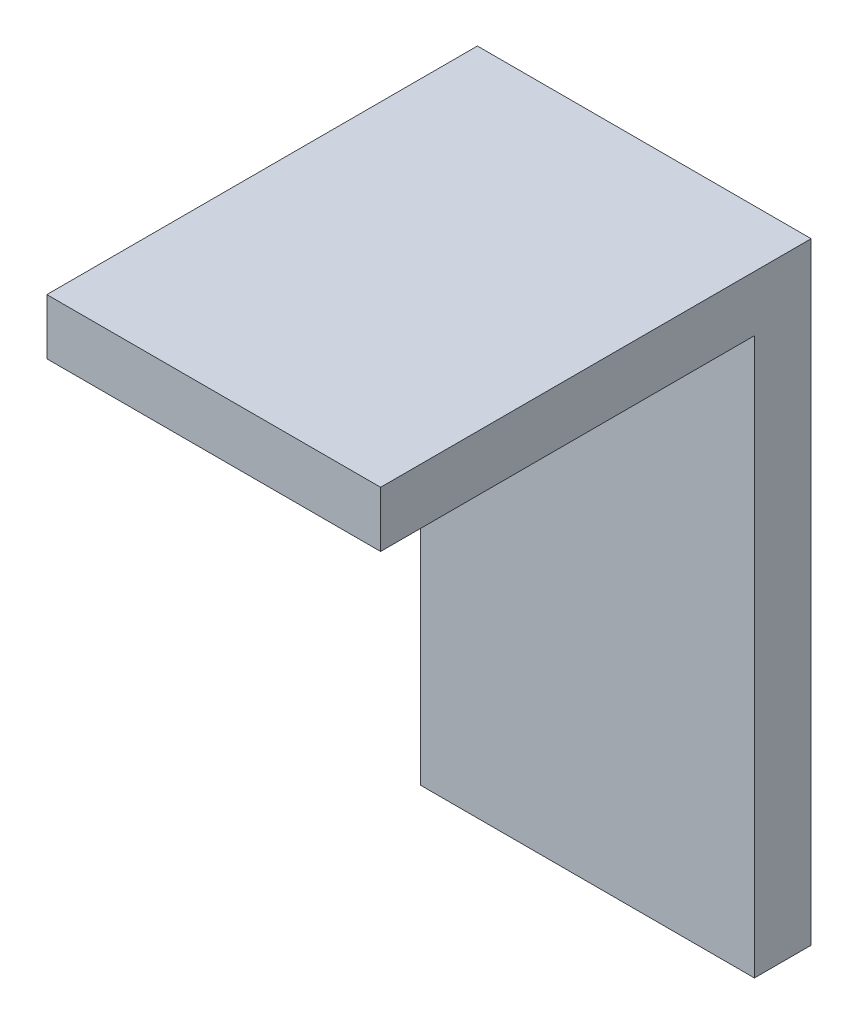
ISO-10303-21;
HEADER;
FILE_DESCRIPTION(('STEP AP214'),'2;1');
FILE_NAME('part.step','',(''),(''),'','','');
FILE_SCHEMA(('AUTOMOTIVE_DESIGN { 1 0 10303 214 1 1 1 1 }'));
ENDSEC;
DATA;
#1=APPLICATION_CONTEXT('core data for automotive mechanical design processes');
#2=APPLICATION_PROTOCOL_DEFINITION('international standard','automotive_design',2000,#1);
#3=PRODUCT_CONTEXT('',#1,'mechanical');
#4=PRODUCT('Part','Part','',(#3));
#5=PRODUCT_RELATED_PRODUCT_CATEGORY('part','',(#4));
#6=PRODUCT_DEFINITION_FORMATION('','',#4);
#7=PRODUCT_DEFINITION_CONTEXT('part definition',#1,'design');
#8=PRODUCT_DEFINITION('design','',#6,#7);
#9=PRODUCT_DEFINITION_SHAPE('','',#8);
#10=(LENGTH_UNIT() NAMED_UNIT(*) SI_UNIT(.MILLI.,.METRE.));
#11=(NAMED_UNIT(*) PLANE_ANGLE_UNIT() SI_UNIT($,.RADIAN.));
#12=(NAMED_UNIT(*) SI_UNIT($,.STERADIAN.) SOLID_ANGLE_UNIT());
#13=UNCERTAINTY_MEASURE_WITH_UNIT(LENGTH_MEASURE(1.E-05),#10,'distance_accuracy_value','');
#14=(GEOMETRIC_REPRESENTATION_CONTEXT(3) GLOBAL_UNCERTAINTY_ASSIGNED_CONTEXT((#13)) GLOBAL_UNIT_ASSIGNED_CONTEXT((#10,
#11,#12)) REPRESENTATION_CONTEXT('',''));
#15=CARTESIAN_POINT('',(0.,0.,0.));
#16=DIRECTION('',(0.,0.,1.));
#17=DIRECTION('',(1.,0.,0.));
#18=AXIS2_PLACEMENT_3D('',#15,#16,#17);
#19=CARTESIAN_POINT('',(3.1,4.55,0.));
#20=DIRECTION('',(-1.,0.,0.));
#21=DIRECTION('',(0.,0.,1.));
#22=AXIS2_PLACEMENT_3D('',#19,#20,#21);
#23=PLANE('',#22);
#24=DIRECTION('',(0.,1.,0.));
#25=VECTOR('',#24,1.);
#26=CARTESIAN_POINT('',(3.1,4.,0.));
#27=LINE('',#26,#25);
#28=CARTESIAN_POINT('',(3.1,4.,0.));
#29=VERTEX_POINT('',#28);
#30=CARTESIAN_POINT('',(3.1,4.55,0.));
#31=VERTEX_POINT('',#30);
#32=EDGE_CURVE('E11',#29,#31,#27,.T.);
#33=ORIENTED_EDGE('',*,*,#32,.F.);
#34=DIRECTION('',(0.,0.,-1.));
#35=VECTOR('',#34,1.);
#36=CARTESIAN_POINT('',(3.1,4.,0.051));
#37=LINE('',#36,#35);
#38=CARTESIAN_POINT('',(3.1,4.,0.051));
#39=VERTEX_POINT('',#38);
#40=EDGE_CURVE('E24',#39,#29,#37,.T.);
#41=ORIENTED_EDGE('',*,*,#40,.F.);
#42=DIRECTION('',(0.,-1.,0.));
#43=VECTOR('',#42,1.);
#44=CARTESIAN_POINT('',(3.1,4.5,0.051));
#45=LINE('',#44,#43);
#46=CARTESIAN_POINT('',(3.1,4.5,0.051));
#47=VERTEX_POINT('',#46);
#48=EDGE_CURVE('E87',#47,#39,#45,.T.);
#49=ORIENTED_EDGE('',*,*,#48,.F.);
#50=DIRECTION('',(0.,0.,-1.));
#51=VECTOR('',#50,1.);
#52=CARTESIAN_POINT('',(3.1,4.5,0.387));
#53=LINE('',#52,#51);
#54=CARTESIAN_POINT('',(3.1,4.5,0.387));
#55=VERTEX_POINT('',#54);
#56=EDGE_CURVE('E114',#55,#47,#53,.T.);
#57=ORIENTED_EDGE('',*,*,#56,.F.);
#58=DIRECTION('',(0.,-1.,0.));
#59=VECTOR('',#58,1.);
#60=CARTESIAN_POINT('',(3.1,4.55,0.387));
#61=LINE('',#60,#59);
#62=CARTESIAN_POINT('',(3.1,4.55,0.387));
#63=VERTEX_POINT('',#62);
#64=EDGE_CURVE('E111',#63,#55,#61,.T.);
#65=ORIENTED_EDGE('',*,*,#64,.F.);
#66=DIRECTION('',(0.,0.,1.));
#67=VECTOR('',#66,1.);
#68=CARTESIAN_POINT('',(3.1,4.55,0.));
#69=LINE('',#68,#67);
#70=EDGE_CURVE('E108',#31,#63,#69,.T.);
#71=ORIENTED_EDGE('',*,*,#70,.F.);
#72=EDGE_LOOP('',(#33,#41,#49,#57,#65,#71));
#73=FACE_BOUND('',#72,.T.);
#74=ADVANCED_FACE('F17',(#73),#23,.T.);
#75=CARTESIAN_POINT('',(3.4,4.,0.));
#76=DIRECTION('',(1.,0.,0.));
#77=DIRECTION('',(0.,0.,1.));
#78=AXIS2_PLACEMENT_3D('',#75,#76,#77);
#79=PLANE('',#78);
#80=DIRECTION('',(0.,-1.,0.));
#81=VECTOR('',#80,1.);
#82=CARTESIAN_POINT('',(3.4,4.55,0.));
#83=LINE('',#82,#81);
#84=CARTESIAN_POINT('',(3.4,4.55,0.));
#85=VERTEX_POINT('',#84);
#86=CARTESIAN_POINT('',(3.4,4.,0.));
#87=VERTEX_POINT('',#86);
#88=EDGE_CURVE('E106',#85,#87,#83,.T.);
#89=ORIENTED_EDGE('',*,*,#88,.F.);
#90=DIRECTION('',(0.,0.,-1.));
#91=VECTOR('',#90,1.);
#92=CARTESIAN_POINT('',(3.4,4.55,0.387));
#93=LINE('',#92,#91);
#94=CARTESIAN_POINT('',(3.4,4.55,0.387));
#95=VERTEX_POINT('',#94);
#96=EDGE_CURVE('E103',#95,#85,#93,.T.);
#97=ORIENTED_EDGE('',*,*,#96,.F.);
#98=DIRECTION('',(0.,1.,0.));
#99=VECTOR('',#98,1.);
#100=CARTESIAN_POINT('',(3.4,4.5,0.387));
#101=LINE('',#100,#99);
#102=CARTESIAN_POINT('',(3.4,4.5,0.387));
#103=VERTEX_POINT('',#102);
#104=EDGE_CURVE('E100',#103,#95,#101,.T.);
#105=ORIENTED_EDGE('',*,*,#104,.F.);
#106=DIRECTION('',(0.,0.,1.));
#107=VECTOR('',#106,1.);
#108=CARTESIAN_POINT('',(3.4,4.5,0.051));
#109=LINE('',#108,#107);
#110=CARTESIAN_POINT('',(3.4,4.5,0.051));
#111=VERTEX_POINT('',#110);
#112=EDGE_CURVE('E72',#111,#103,#109,.T.);
#113=ORIENTED_EDGE('',*,*,#112,.F.);
#114=DIRECTION('',(0.,1.,0.));
#115=VECTOR('',#114,1.);
#116=CARTESIAN_POINT('',(3.4,4.,0.051));
#117=LINE('',#116,#115);
#118=CARTESIAN_POINT('',(3.4,4.,0.051));
#119=VERTEX_POINT('',#118);
#120=EDGE_CURVE('E66',#119,#111,#117,.T.);
#121=ORIENTED_EDGE('',*,*,#120,.F.);
#122=DIRECTION('',(0.,0.,1.));
#123=VECTOR('',#122,1.);
#124=CARTESIAN_POINT('',(3.4,4.,0.));
#125=LINE('',#124,#123);
#126=EDGE_CURVE('E69',#87,#119,#125,.T.);
#127=ORIENTED_EDGE('',*,*,#126,.F.);
#128=EDGE_LOOP('',(#89,#97,#105,#113,#121,#127));
#129=FACE_BOUND('',#128,.T.);
#130=ADVANCED_FACE('F68',(#129),#79,.T.);
#131=CARTESIAN_POINT('',(3.1,4.55,0.387));
#132=DIRECTION('',(0.,0.,1.));
#133=DIRECTION('',(0.,1.,0.));
#134=AXIS2_PLACEMENT_3D('',#131,#132,#133);
#135=PLANE('',#134);
#136=ORIENTED_EDGE('',*,*,#64,.T.);
#137=DIRECTION('',(-1.,0.,0.));
#138=VECTOR('',#137,1.);
#139=CARTESIAN_POINT('',(3.4,4.5,0.387));
#140=LINE('',#139,#138);
#141=EDGE_CURVE('E83',#103,#55,#140,.T.);
#142=ORIENTED_EDGE('',*,*,#141,.F.);
#143=ORIENTED_EDGE('',*,*,#104,.T.);
#144=DIRECTION('',(1.,0.,0.));
#145=VECTOR('',#144,1.);
#146=CARTESIAN_POINT('',(3.1,4.55,0.387));
#147=LINE('',#146,#145);
#148=EDGE_CURVE('E88',#63,#95,#147,.T.);
#149=ORIENTED_EDGE('',*,*,#148,.F.);
#150=EDGE_LOOP('',(#136,#142,#143,#149));
#151=FACE_BOUND('',#150,.T.);
#152=ADVANCED_FACE('F125',(#151),#135,.T.);
#153=CARTESIAN_POINT('',(3.1,4.5,0.051));
#154=DIRECTION('',(0.,0.,1.));
#155=DIRECTION('',(0.,1.,0.));
#156=AXIS2_PLACEMENT_3D('',#153,#154,#155);
#157=PLANE('',#156);
#158=ORIENTED_EDGE('',*,*,#48,.T.);
#159=DIRECTION('',(-1.,0.,0.));
#160=VECTOR('',#159,1.);
#161=CARTESIAN_POINT('',(3.4,4.,0.051));
#162=LINE('',#161,#160);
#163=EDGE_CURVE('E81',#119,#39,#162,.T.);
#164=ORIENTED_EDGE('',*,*,#163,.F.);
#165=ORIENTED_EDGE('',*,*,#120,.T.);
#166=DIRECTION('',(1.,0.,0.));
#167=VECTOR('',#166,1.);
#168=CARTESIAN_POINT('',(3.1,4.5,0.051));
#169=LINE('',#168,#167);
#170=EDGE_CURVE('E89',#47,#111,#169,.T.);
#171=ORIENTED_EDGE('',*,*,#170,.F.);
#172=EDGE_LOOP('',(#158,#164,#165,#171));
#173=FACE_BOUND('',#172,.T.);
#174=ADVANCED_FACE('F86',(#173),#157,.T.);
#175=CARTESIAN_POINT('',(3.4,4.55,0.));
#176=DIRECTION('',(0.,1.,0.));
#177=DIRECTION('',(0.,0.,1.));
#178=AXIS2_PLACEMENT_3D('',#175,#176,#177);
#179=PLANE('',#178);
#180=DIRECTION('',(1.,0.,0.));
#181=VECTOR('',#180,1.);
#182=CARTESIAN_POINT('',(3.1,4.55,0.));
#183=LINE('',#182,#181);
#184=EDGE_CURVE('E93',#31,#85,#183,.T.);
#185=ORIENTED_EDGE('',*,*,#184,.F.);
#186=ORIENTED_EDGE('',*,*,#70,.T.);
#187=ORIENTED_EDGE('',*,*,#148,.T.);
#188=ORIENTED_EDGE('',*,*,#96,.T.);
#189=EDGE_LOOP('',(#185,#186,#187,#188));
#190=FACE_BOUND('',#189,.T.);
#191=ADVANCED_FACE('F121',(#190),#179,.T.);
#192=CARTESIAN_POINT('',(3.1,4.,0.));
#193=DIRECTION('',(0.,-1.,0.));
#194=DIRECTION('',(0.,0.,1.));
#195=AXIS2_PLACEMENT_3D('',#192,#193,#194);
#196=PLANE('',#195);
#197=DIRECTION('',(-1.,0.,0.));
#198=VECTOR('',#197,1.);
#199=CARTESIAN_POINT('',(3.4,4.,0.));
#200=LINE('',#199,#198);
#201=EDGE_CURVE('E82',#87,#29,#200,.T.);
#202=ORIENTED_EDGE('',*,*,#201,.F.);
#203=ORIENTED_EDGE('',*,*,#126,.T.);
#204=ORIENTED_EDGE('',*,*,#163,.T.);
#205=ORIENTED_EDGE('',*,*,#40,.T.);
#206=EDGE_LOOP('',(#202,#203,#204,#205));
#207=FACE_BOUND('',#206,.T.);
#208=ADVANCED_FACE('F80',(#207),#196,.T.);
#209=CARTESIAN_POINT('',(3.1,4.5,0.051));
#210=DIRECTION('',(0.,-1.,0.));
#211=DIRECTION('',(0.,0.,1.));
#212=AXIS2_PLACEMENT_3D('',#209,#210,#211);
#213=PLANE('',#212);
#214=ORIENTED_EDGE('',*,*,#170,.T.);
#215=ORIENTED_EDGE('',*,*,#112,.T.);
#216=ORIENTED_EDGE('',*,*,#141,.T.);
#217=ORIENTED_EDGE('',*,*,#56,.T.);
#218=EDGE_LOOP('',(#214,#215,#216,#217));
#219=FACE_BOUND('',#218,.T.);
#220=ADVANCED_FACE('F127',(#219),#213,.T.);
#221=CARTESIAN_POINT('',(3.4,4.55,0.));
#222=DIRECTION('',(0.,0.,-1.));
#223=DIRECTION('',(0.,1.,0.));
#224=AXIS2_PLACEMENT_3D('',#221,#222,#223);
#225=PLANE('',#224);
#226=ORIENTED_EDGE('',*,*,#88,.T.);
#227=ORIENTED_EDGE('',*,*,#201,.T.);
#228=ORIENTED_EDGE('',*,*,#32,.T.);
#229=ORIENTED_EDGE('',*,*,#184,.T.);
#230=EDGE_LOOP('',(#226,#227,#228,#229));
#231=FACE_BOUND('',#230,.T.);
#232=ADVANCED_FACE('F117',(#231),#225,.T.);
#233=CLOSED_SHELL('',(#74,#130,#152,#174,#191,#208,#220,#232));
#234=MANIFOLD_SOLID_BREP('B1',#233);
#235=ADVANCED_BREP_SHAPE_REPRESENTATION('',(#18,#234),#14);
#236=SHAPE_DEFINITION_REPRESENTATION(#9,#235);
ENDSEC;
END-ISO-10303-21;
